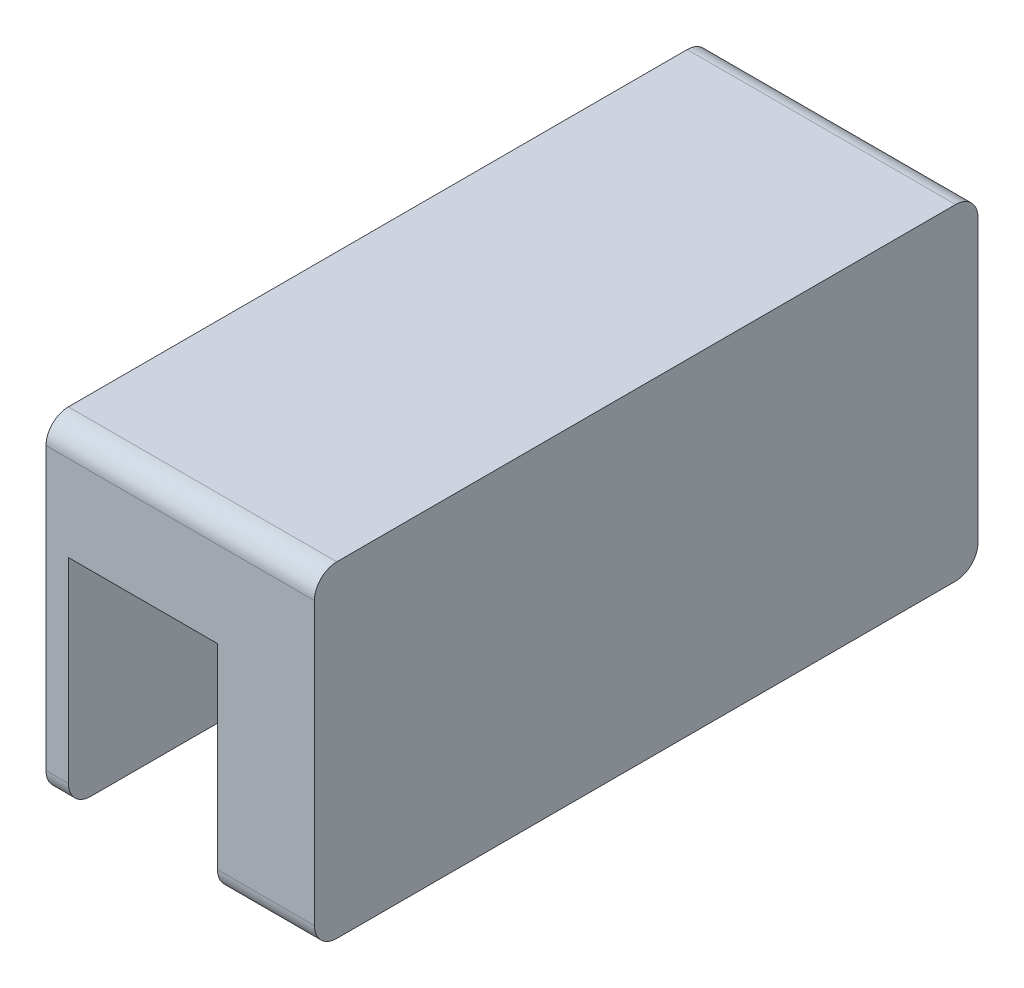
ISO-10303-21;
HEADER;
FILE_DESCRIPTION(('STEP AP214'),'2;1');
FILE_NAME('part.step','',(''),(''),'','','');
FILE_SCHEMA(('AUTOMOTIVE_DESIGN { 1 0 10303 214 1 1 1 1 }'));
ENDSEC;
DATA;
#1=APPLICATION_CONTEXT('core data for automotive mechanical design processes');
#2=APPLICATION_PROTOCOL_DEFINITION('international standard','automotive_design',2000,#1);
#3=PRODUCT_CONTEXT('',#1,'mechanical');
#4=PRODUCT('Part','Part','',(#3));
#5=PRODUCT_RELATED_PRODUCT_CATEGORY('part','',(#4));
#6=PRODUCT_DEFINITION_FORMATION('','',#4);
#7=PRODUCT_DEFINITION_CONTEXT('part definition',#1,'design');
#8=PRODUCT_DEFINITION('design','',#6,#7);
#9=PRODUCT_DEFINITION_SHAPE('','',#8);
#10=(LENGTH_UNIT() NAMED_UNIT(*) SI_UNIT(.MILLI.,.METRE.));
#11=(NAMED_UNIT(*) PLANE_ANGLE_UNIT() SI_UNIT($,.RADIAN.));
#12=(NAMED_UNIT(*) SI_UNIT($,.STERADIAN.) SOLID_ANGLE_UNIT());
#13=UNCERTAINTY_MEASURE_WITH_UNIT(LENGTH_MEASURE(1.E-05),#10,'distance_accuracy_value','');
#14=(GEOMETRIC_REPRESENTATION_CONTEXT(3) GLOBAL_UNCERTAINTY_ASSIGNED_CONTEXT((#13)) GLOBAL_UNIT_ASSIGNED_CONTEXT((#10,
#11,#12)) REPRESENTATION_CONTEXT('',''));
#15=CARTESIAN_POINT('',(0.,0.,0.));
#16=DIRECTION('',(0.,0.,1.));
#17=DIRECTION('',(1.,0.,0.));
#18=AXIS2_PLACEMENT_3D('',#15,#16,#17);
#19=CARTESIAN_POINT('',(30.,20.9769260765077,-25.4015999198652));
#20=DIRECTION('',(-1.,0.,0.));
#21=DIRECTION('',(0.,0.,1.));
#22=AXIS2_PLACEMENT_3D('',#19,#20,#21);
#23=CYLINDRICAL_SURFACE('',#22,3.);
#24=CARTESIAN_POINT('',(-3.,20.9769260765077,-25.4015999198652));
#25=DIRECTION('',(-1.,0.,0.));
#26=DIRECTION('',(0.,0.,-1.));
#27=AXIS2_PLACEMENT_3D('',#24,#25,#26);
#28=CIRCLE('',#27,3.);
#29=CARTESIAN_POINT('',(-3.,23.9769260765077,-25.4015999198652));
#30=VERTEX_POINT('',#29);
#31=CARTESIAN_POINT('',(-3.,20.9769260765077,-28.4015999198652));
#32=VERTEX_POINT('',#31);
#33=EDGE_CURVE('E249',#30,#32,#28,.T.);
#34=ORIENTED_EDGE('',*,*,#33,.F.);
#35=DIRECTION('',(-1.,0.,0.));
#36=VECTOR('',#35,1.);
#37=CARTESIAN_POINT('',(30.,23.9769260765077,-25.4015999198652));
#38=LINE('',#37,#36);
#39=CARTESIAN_POINT('',(33.,23.9769260765077,-25.4015999198652));
#40=VERTEX_POINT('',#39);
#41=EDGE_CURVE('E11',#40,#30,#38,.T.);
#42=ORIENTED_EDGE('',*,*,#41,.F.);
#43=CARTESIAN_POINT('',(33.,20.9769260765077,-25.4015999198652));
#44=DIRECTION('',(1.,0.,0.));
#45=DIRECTION('',(0.,0.,1.));
#46=AXIS2_PLACEMENT_3D('',#43,#44,#45);
#47=CIRCLE('',#46,3.);
#48=CARTESIAN_POINT('',(33.,20.9769260765077,-28.4015999198652));
#49=VERTEX_POINT('',#48);
#50=EDGE_CURVE('E191',#49,#40,#47,.T.);
#51=ORIENTED_EDGE('',*,*,#50,.F.);
#52=DIRECTION('',(-1.,0.,0.));
#53=VECTOR('',#52,1.);
#54=CARTESIAN_POINT('',(30.,20.9769260765077,-28.4015999198652));
#55=LINE('',#54,#53);
#56=EDGE_CURVE('E303',#49,#32,#55,.T.);
#57=ORIENTED_EDGE('',*,*,#56,.T.);
#58=EDGE_LOOP('',(#34,#42,#51,#57));
#59=FACE_BOUND('',#58,.T.);
#60=ADVANCED_FACE('F33',(#59),#23,.T.);
#61=CARTESIAN_POINT('',(30.,23.9769260765077,57.5984000801349));
#62=DIRECTION('',(0.,-1.,0.));
#63=DIRECTION('',(0.,0.,-1.));
#64=AXIS2_PLACEMENT_3D('',#61,#62,#63);
#65=PLANE('',#64);
#66=DIRECTION('',(0.,0.,-1.));
#67=VECTOR('',#66,1.);
#68=CARTESIAN_POINT('',(-3.,23.9769260765077,16.0984000801349));
#69=LINE('',#68,#67);
#70=CARTESIAN_POINT('',(-3.,23.9769260765077,57.5984000801349));
#71=VERTEX_POINT('',#70);
#72=EDGE_CURVE('E175',#71,#30,#69,.T.);
#73=ORIENTED_EDGE('',*,*,#72,.F.);
#74=DIRECTION('',(-1.,0.,0.));
#75=VECTOR('',#74,1.);
#76=CARTESIAN_POINT('',(30.,23.9769260765077,57.5984000801349));
#77=LINE('',#76,#75);
#78=CARTESIAN_POINT('',(33.,23.9769260765077,57.5984000801349));
#79=VERTEX_POINT('',#78);
#80=EDGE_CURVE('E40',#79,#71,#77,.T.);
#81=ORIENTED_EDGE('',*,*,#80,.F.);
#82=DIRECTION('',(0.,0.,1.));
#83=VECTOR('',#82,1.);
#84=CARTESIAN_POINT('',(33.,23.9769260765077,16.0984000801349));
#85=LINE('',#84,#83);
#86=EDGE_CURVE('E172',#40,#79,#85,.T.);
#87=ORIENTED_EDGE('',*,*,#86,.F.);
#88=ORIENTED_EDGE('',*,*,#41,.T.);
#89=EDGE_LOOP('',(#73,#81,#87,#88));
#90=FACE_BOUND('',#89,.T.);
#91=ADVANCED_FACE('F170',(#90),#65,.F.);
#92=CARTESIAN_POINT('',(30.,20.9769260765077,57.5984000801349));
#93=DIRECTION('',(-1.,0.,0.));
#94=DIRECTION('',(0.,0.,1.));
#95=AXIS2_PLACEMENT_3D('',#92,#93,#94);
#96=CYLINDRICAL_SURFACE('',#95,3.);
#97=CARTESIAN_POINT('',(-3.,20.9769260765077,57.5984000801349));
#98=DIRECTION('',(-1.,0.,0.));
#99=DIRECTION('',(0.,0.,-1.));
#100=AXIS2_PLACEMENT_3D('',#97,#98,#99);
#101=CIRCLE('',#100,3.);
#102=CARTESIAN_POINT('',(-3.,20.9769260765077,60.5984000801349));
#103=VERTEX_POINT('',#102);
#104=EDGE_CURVE('E245',#103,#71,#101,.T.);
#105=ORIENTED_EDGE('',*,*,#104,.F.);
#106=DIRECTION('',(-1.,0.,0.));
#107=VECTOR('',#106,1.);
#108=CARTESIAN_POINT('',(30.,20.9769260765077,60.5984000801349));
#109=LINE('',#108,#107);
#110=CARTESIAN_POINT('',(33.,20.9769260765077,60.5984000801349));
#111=VERTEX_POINT('',#110);
#112=EDGE_CURVE('E179',#111,#103,#109,.T.);
#113=ORIENTED_EDGE('',*,*,#112,.F.);
#114=CARTESIAN_POINT('',(33.,20.9769260765077,57.5984000801349));
#115=DIRECTION('',(1.,0.,0.));
#116=DIRECTION('',(0.,0.,1.));
#117=AXIS2_PLACEMENT_3D('',#114,#115,#116);
#118=CIRCLE('',#117,3.);
#119=EDGE_CURVE('E181',#79,#111,#118,.T.);
#120=ORIENTED_EDGE('',*,*,#119,.F.);
#121=ORIENTED_EDGE('',*,*,#80,.T.);
#122=EDGE_LOOP('',(#105,#113,#120,#121));
#123=FACE_BOUND('',#122,.T.);
#124=ADVANCED_FACE('F182',(#123),#96,.T.);
#125=CARTESIAN_POINT('',(30.,9.47692607650769,60.5984000801349));
#126=DIRECTION('',(0.,0.,-1.));
#127=DIRECTION('',(0.,1.,0.));
#128=AXIS2_PLACEMENT_3D('',#125,#126,#127);
#129=PLANE('',#128);
#130=DIRECTION('',(-1.,0.,0.));
#131=VECTOR('',#130,1.);
#132=CARTESIAN_POINT('',(30.,9.47692607650769,60.5984000801349));
#133=LINE('',#132,#131);
#134=CARTESIAN_POINT('',(20.,9.47692607650769,60.5984000801349));
#135=VERTEX_POINT('',#134);
#136=CARTESIAN_POINT('',(0.,9.47692607650772,60.5984000801349));
#137=VERTEX_POINT('',#136);
#138=EDGE_CURVE('E319',#135,#137,#133,.T.);
#139=ORIENTED_EDGE('',*,*,#138,.F.);
#140=DIRECTION('',(0.,-1.,0.));
#141=VECTOR('',#140,1.);
#142=CARTESIAN_POINT('',(20.,20.9769260765077,60.5984000801349));
#143=LINE('',#142,#141);
#144=CARTESIAN_POINT('',(20.,-16.7730739234923,60.5984000801349));
#145=VERTEX_POINT('',#144);
#146=EDGE_CURVE('E207',#135,#145,#143,.T.);
#147=ORIENTED_EDGE('',*,*,#146,.T.);
#148=DIRECTION('',(1.,0.,0.));
#149=VECTOR('',#148,1.);
#150=CARTESIAN_POINT('',(20.,-16.7730739234923,60.5984000801349));
#151=LINE('',#150,#149);
#152=CARTESIAN_POINT('',(33.,-16.7730739234923,60.5984000801349));
#153=VERTEX_POINT('',#152);
#154=EDGE_CURVE('E221',#145,#153,#151,.T.);
#155=ORIENTED_EDGE('',*,*,#154,.T.);
#156=DIRECTION('',(0.,-1.,0.));
#157=VECTOR('',#156,1.);
#158=CARTESIAN_POINT('',(33.,20.9769260765077,60.5984000801349));
#159=LINE('',#158,#157);
#160=EDGE_CURVE('E186',#111,#153,#159,.T.);
#161=ORIENTED_EDGE('',*,*,#160,.F.);
#162=ORIENTED_EDGE('',*,*,#112,.T.);
#163=DIRECTION('',(0.,1.,0.));
#164=VECTOR('',#163,1.);
#165=CARTESIAN_POINT('',(-3.,15.2269260765077,60.5984000801349));
#166=LINE('',#165,#164);
#167=CARTESIAN_POINT('',(-3.,-16.7730739234923,60.5984000801349));
#168=VERTEX_POINT('',#167);
#169=EDGE_CURVE('E242',#168,#103,#166,.T.);
#170=ORIENTED_EDGE('',*,*,#169,.F.);
#171=DIRECTION('',(1.,0.,0.));
#172=VECTOR('',#171,1.);
#173=CARTESIAN_POINT('',(-3.,-16.7730739234923,60.5984000801349));
#174=LINE('',#173,#172);
#175=CARTESIAN_POINT('',(0.,-16.7730739234923,60.5984000801349));
#176=VERTEX_POINT('',#175);
#177=EDGE_CURVE('E260',#168,#176,#174,.T.);
#178=ORIENTED_EDGE('',*,*,#177,.T.);
#179=DIRECTION('',(0.,1.,0.));
#180=VECTOR('',#179,1.);
#181=CARTESIAN_POINT('',(0.,15.2269260765077,60.5984000801349));
#182=LINE('',#181,#180);
#183=EDGE_CURVE('E241',#176,#137,#182,.T.);
#184=ORIENTED_EDGE('',*,*,#183,.T.);
#185=EDGE_LOOP('',(#139,#147,#155,#161,#162,#170,#178,#184));
#186=FACE_BOUND('',#185,.T.);
#187=ADVANCED_FACE('F323',(#186),#129,.F.);
#188=CARTESIAN_POINT('',(30.,9.47692607650771,57.5984000801349));
#189=DIRECTION('',(-1.,0.,0.));
#190=DIRECTION('',(0.,0.,1.));
#191=AXIS2_PLACEMENT_3D('',#188,#189,#190);
#192=CYLINDRICAL_SURFACE('',#191,2.99999999999999);
#193=DIRECTION('',(-1.,0.,0.));
#194=VECTOR('',#193,1.);
#195=CARTESIAN_POINT('',(30.,12.3387436807585,56.6984000801349));
#196=LINE('',#195,#194);
#197=CARTESIAN_POINT('',(20.,12.3387436807585,56.6984000801349));
#198=VERTEX_POINT('',#197);
#199=CARTESIAN_POINT('',(0.,12.3387436807585,56.6984000801349));
#200=VERTEX_POINT('',#199);
#201=EDGE_CURVE('E317',#198,#200,#196,.T.);
#202=ORIENTED_EDGE('',*,*,#201,.F.);
#203=CARTESIAN_POINT('',(20.,9.47692607650771,57.5984000801349));
#204=DIRECTION('',(-1.,0.,0.));
#205=DIRECTION('',(0.,0.,1.));
#206=AXIS2_PLACEMENT_3D('',#203,#204,#205);
#207=CIRCLE('',#206,2.99999999999999);
#208=EDGE_CURVE('E47',#198,#135,#207,.F.);
#209=ORIENTED_EDGE('',*,*,#208,.T.);
#210=ORIENTED_EDGE('',*,*,#138,.T.);
#211=CARTESIAN_POINT('',(0.,9.47692607650771,57.5984000801349));
#212=DIRECTION('',(-1.,0.,0.));
#213=DIRECTION('',(0.,0.,1.));
#214=AXIS2_PLACEMENT_3D('',#211,#212,#213);
#215=CIRCLE('',#214,2.99999999999999);
#216=EDGE_CURVE('E282',#137,#200,#215,.T.);
#217=ORIENTED_EDGE('',*,*,#216,.T.);
#218=EDGE_LOOP('',(#202,#209,#210,#217));
#219=FACE_BOUND('',#218,.T.);
#220=ADVANCED_FACE('F341',(#219),#192,.F.);
#221=CARTESIAN_POINT('',(30.,-0.0624659376617931,60.5984000801348));
#222=DIRECTION('',(-1.,0.,0.));
#223=DIRECTION('',(0.,0.,1.));
#224=AXIS2_PLACEMENT_3D('',#221,#222,#223);
#225=CYLINDRICAL_SURFACE('',#224,13.);
#226=DIRECTION('',(-1.,0.,0.));
#227=VECTOR('',#226,1.);
#228=CARTESIAN_POINT('',(30.,5.58970797538169,48.8914393277999));
#229=LINE('',#228,#227);
#230=CARTESIAN_POINT('',(20.,5.58970797538169,48.8914393277999));
#231=VERTEX_POINT('',#230);
#232=CARTESIAN_POINT('',(0.,5.58970797538169,48.8914393277999));
#233=VERTEX_POINT('',#232);
#234=EDGE_CURVE('E315',#231,#233,#229,.T.);
#235=ORIENTED_EDGE('',*,*,#234,.F.);
#236=CARTESIAN_POINT('',(20.,-0.0624659376617931,60.5984000801348));
#237=DIRECTION('',(-1.,0.,0.));
#238=DIRECTION('',(0.,0.,1.));
#239=AXIS2_PLACEMENT_3D('',#236,#237,#238);
#240=CIRCLE('',#239,13.);
#241=EDGE_CURVE('E55',#231,#198,#240,.F.);
#242=ORIENTED_EDGE('',*,*,#241,.T.);
#243=ORIENTED_EDGE('',*,*,#201,.T.);
#244=CARTESIAN_POINT('',(0.,-0.0624659376617931,60.5984000801348));
#245=DIRECTION('',(-1.,0.,0.));
#246=DIRECTION('',(0.,0.,-1.));
#247=AXIS2_PLACEMENT_3D('',#244,#245,#246);
#248=CIRCLE('',#247,13.);
#249=EDGE_CURVE('E285',#200,#233,#248,.T.);
#250=ORIENTED_EDGE('',*,*,#249,.T.);
#251=EDGE_LOOP('',(#235,#242,#243,#250));
#252=FACE_BOUND('',#251,.T.);
#253=ADVANCED_FACE('F395',(#252),#225,.F.);
#254=CARTESIAN_POINT('',(30.,9.93753406233823,39.8860849029268));
#255=DIRECTION('',(-1.,0.,0.));
#256=DIRECTION('',(0.,0.,1.));
#257=AXIS2_PLACEMENT_3D('',#254,#255,#256);
#258=CYLINDRICAL_SURFACE('',#257,10.);
#259=DIRECTION('',(-1.,0.,0.));
#260=VECTOR('',#259,1.);
#261=CARTESIAN_POINT('',(30.,-0.0624659376617792,39.8860849029268));
#262=LINE('',#261,#260);
#263=CARTESIAN_POINT('',(20.,-0.0624659376617792,39.8860849029268));
#264=VERTEX_POINT('',#263);
#265=CARTESIAN_POINT('',(0.,-0.0624659376617792,39.8860849029268));
#266=VERTEX_POINT('',#265);
#267=EDGE_CURVE('E313',#264,#266,#262,.T.);
#268=ORIENTED_EDGE('',*,*,#267,.F.);
#269=CARTESIAN_POINT('',(20.,9.93753406233823,39.8860849029268));
#270=DIRECTION('',(-1.,0.,0.));
#271=DIRECTION('',(0.,0.,1.));
#272=AXIS2_PLACEMENT_3D('',#269,#270,#271);
#273=CIRCLE('',#272,10.);
#274=EDGE_CURVE('E237',#264,#231,#273,.T.);
#275=ORIENTED_EDGE('',*,*,#274,.T.);
#276=ORIENTED_EDGE('',*,*,#234,.T.);
#277=CARTESIAN_POINT('',(0.,9.93753406233823,39.8860849029268));
#278=DIRECTION('',(1.,0.,0.));
#279=DIRECTION('',(0.,0.,-1.));
#280=AXIS2_PLACEMENT_3D('',#277,#278,#279);
#281=CIRCLE('',#280,10.);
#282=EDGE_CURVE('E288',#233,#266,#281,.T.);
#283=ORIENTED_EDGE('',*,*,#282,.T.);
#284=EDGE_LOOP('',(#268,#275,#276,#283));
#285=FACE_BOUND('',#284,.T.);
#286=ADVANCED_FACE('F394',(#285),#258,.T.);
#287=CARTESIAN_POINT('',(30.,-0.0624659376617792,-7.68928474265718));
#288=DIRECTION('',(0.,1.,0.));
#289=DIRECTION('',(0.,0.,1.));
#290=AXIS2_PLACEMENT_3D('',#287,#288,#289);
#291=PLANE('',#290);
#292=DIRECTION('',(-1.,0.,0.));
#293=VECTOR('',#292,1.);
#294=CARTESIAN_POINT('',(30.,-0.0624659376617775,-7.68928474265718));
#295=LINE('',#294,#293);
#296=CARTESIAN_POINT('',(20.,-0.0624659376617775,-7.68928474265718));
#297=VERTEX_POINT('',#296);
#298=CARTESIAN_POINT('',(0.,-0.0624659376617775,-7.68928474265718));
#299=VERTEX_POINT('',#298);
#300=EDGE_CURVE('E311',#297,#299,#295,.T.);
#301=ORIENTED_EDGE('',*,*,#300,.F.);
#302=DIRECTION('',(0.,0.,1.));
#303=VECTOR('',#302,1.);
#304=CARTESIAN_POINT('',(20.,-0.0624659376617792,-7.68928474265718));
#305=LINE('',#304,#303);
#306=EDGE_CURVE('E235',#297,#264,#305,.T.);
#307=ORIENTED_EDGE('',*,*,#306,.T.);
#308=ORIENTED_EDGE('',*,*,#267,.T.);
#309=DIRECTION('',(0.,0.,-1.));
#310=VECTOR('',#309,1.);
#311=CARTESIAN_POINT('',(0.,-0.0624659376617792,-7.68928474265718));
#312=LINE('',#311,#310);
#313=EDGE_CURVE('E291',#266,#299,#312,.T.);
#314=ORIENTED_EDGE('',*,*,#313,.T.);
#315=EDGE_LOOP('',(#301,#307,#308,#314));
#316=FACE_BOUND('',#315,.T.);
#317=ADVANCED_FACE('F390',(#316),#291,.F.);
#318=CARTESIAN_POINT('',(30.,9.93753406233823,-7.68928474265718));
#319=DIRECTION('',(-1.,0.,0.));
#320=DIRECTION('',(0.,0.,1.));
#321=AXIS2_PLACEMENT_3D('',#318,#319,#320);
#322=CYLINDRICAL_SURFACE('',#321,10.);
#323=DIRECTION('',(-1.,0.,0.));
#324=VECTOR('',#323,1.);
#325=CARTESIAN_POINT('',(30.,5.58970797538169,-16.6946391675302));
#326=LINE('',#325,#324);
#327=CARTESIAN_POINT('',(20.,5.58970797538169,-16.6946391675302));
#328=VERTEX_POINT('',#327);
#329=CARTESIAN_POINT('',(0.,5.58970797538169,-16.6946391675302));
#330=VERTEX_POINT('',#329);
#331=EDGE_CURVE('E309',#328,#330,#326,.T.);
#332=ORIENTED_EDGE('',*,*,#331,.F.);
#333=CARTESIAN_POINT('',(20.,9.93753406233823,-7.68928474265718));
#334=DIRECTION('',(-1.,0.,0.));
#335=DIRECTION('',(0.,0.,1.));
#336=AXIS2_PLACEMENT_3D('',#333,#334,#335);
#337=CIRCLE('',#336,10.);
#338=EDGE_CURVE('E233',#328,#297,#337,.T.);
#339=ORIENTED_EDGE('',*,*,#338,.T.);
#340=ORIENTED_EDGE('',*,*,#300,.T.);
#341=CARTESIAN_POINT('',(0.,9.93753406233823,-7.68928474265718));
#342=DIRECTION('',(1.,0.,0.));
#343=DIRECTION('',(0.,0.,1.));
#344=AXIS2_PLACEMENT_3D('',#341,#342,#343);
#345=CIRCLE('',#344,10.);
#346=EDGE_CURVE('E294',#299,#330,#345,.T.);
#347=ORIENTED_EDGE('',*,*,#346,.T.);
#348=EDGE_LOOP('',(#332,#339,#340,#347));
#349=FACE_BOUND('',#348,.T.);
#350=ADVANCED_FACE('F387',(#349),#322,.T.);
#351=CARTESIAN_POINT('',(30.,-0.0624659376617931,-28.4015999198652));
#352=DIRECTION('',(-1.,0.,0.));
#353=DIRECTION('',(0.,0.,1.));
#354=AXIS2_PLACEMENT_3D('',#351,#352,#353);
#355=CYLINDRICAL_SURFACE('',#354,13.);
#356=DIRECTION('',(-1.,0.,0.));
#357=VECTOR('',#356,1.);
#358=CARTESIAN_POINT('',(30.,12.3387436807586,-24.5015999198653));
#359=LINE('',#358,#357);
#360=CARTESIAN_POINT('',(20.,12.3387436807586,-24.5015999198653));
#361=VERTEX_POINT('',#360);
#362=CARTESIAN_POINT('',(0.,12.3387436807586,-24.5015999198653));
#363=VERTEX_POINT('',#362);
#364=EDGE_CURVE('E307',#361,#363,#359,.T.);
#365=ORIENTED_EDGE('',*,*,#364,.F.);
#366=CARTESIAN_POINT('',(20.,-0.0624659376617931,-28.4015999198652));
#367=DIRECTION('',(-1.,0.,0.));
#368=DIRECTION('',(0.,0.,1.));
#369=AXIS2_PLACEMENT_3D('',#366,#367,#368);
#370=CIRCLE('',#369,13.);
#371=EDGE_CURVE('E231',#361,#328,#370,.F.);
#372=ORIENTED_EDGE('',*,*,#371,.T.);
#373=ORIENTED_EDGE('',*,*,#331,.T.);
#374=CARTESIAN_POINT('',(0.,-0.0624659376617931,-28.4015999198652));
#375=DIRECTION('',(-1.,0.,0.));
#376=DIRECTION('',(0.,0.,1.));
#377=AXIS2_PLACEMENT_3D('',#374,#375,#376);
#378=CIRCLE('',#377,13.);
#379=EDGE_CURVE('E297',#330,#363,#378,.T.);
#380=ORIENTED_EDGE('',*,*,#379,.T.);
#381=EDGE_LOOP('',(#365,#372,#373,#380));
#382=FACE_BOUND('',#381,.T.);
#383=ADVANCED_FACE('F381',(#382),#355,.F.);
#384=CARTESIAN_POINT('',(30.,9.47692607650771,-25.4015999198653));
#385=DIRECTION('',(-1.,0.,0.));
#386=DIRECTION('',(0.,0.,1.));
#387=AXIS2_PLACEMENT_3D('',#384,#385,#386);
#388=CYLINDRICAL_SURFACE('',#387,2.99999999999999);
#389=DIRECTION('',(-1.,0.,0.));
#390=VECTOR('',#389,1.);
#391=CARTESIAN_POINT('',(30.,9.47692607650769,-28.4015999198653));
#392=LINE('',#391,#390);
#393=CARTESIAN_POINT('',(20.,9.47692607650769,-28.4015999198653));
#394=VERTEX_POINT('',#393);
#395=CARTESIAN_POINT('',(0.,9.47692607650772,-28.4015999198652));
#396=VERTEX_POINT('',#395);
#397=EDGE_CURVE('E305',#394,#396,#392,.T.);
#398=ORIENTED_EDGE('',*,*,#397,.F.);
#399=CARTESIAN_POINT('',(20.,9.47692607650771,-25.4015999198653));
#400=DIRECTION('',(-1.,0.,0.));
#401=DIRECTION('',(0.,0.,1.));
#402=AXIS2_PLACEMENT_3D('',#399,#400,#401);
#403=CIRCLE('',#402,2.99999999999999);
#404=EDGE_CURVE('E224',#394,#361,#403,.F.);
#405=ORIENTED_EDGE('',*,*,#404,.T.);
#406=ORIENTED_EDGE('',*,*,#364,.T.);
#407=CARTESIAN_POINT('',(0.,9.47692607650771,-25.4015999198653));
#408=DIRECTION('',(-1.,0.,0.));
#409=DIRECTION('',(0.,0.,-1.));
#410=AXIS2_PLACEMENT_3D('',#407,#408,#409);
#411=CIRCLE('',#410,2.99999999999999);
#412=EDGE_CURVE('E300',#363,#396,#411,.T.);
#413=ORIENTED_EDGE('',*,*,#412,.T.);
#414=EDGE_LOOP('',(#398,#405,#406,#413));
#415=FACE_BOUND('',#414,.T.);
#416=ADVANCED_FACE('F378',(#415),#388,.F.);
#417=CARTESIAN_POINT('',(30.,9.47692607650769,-28.4015999198653));
#418=DIRECTION('',(0.,0.,1.));
#419=DIRECTION('',(0.,-1.,0.));
#420=AXIS2_PLACEMENT_3D('',#417,#418,#419);
#421=PLANE('',#420);
#422=DIRECTION('',(0.,1.,0.));
#423=VECTOR('',#422,1.);
#424=CARTESIAN_POINT('',(20.,15.2269260765077,-28.4015999198652));
#425=LINE('',#424,#423);
#426=CARTESIAN_POINT('',(20.,-16.7730739234923,-28.4015999198652));
#427=VERTEX_POINT('',#426);
#428=EDGE_CURVE('E218',#427,#394,#425,.T.);
#429=ORIENTED_EDGE('',*,*,#428,.T.);
#430=ORIENTED_EDGE('',*,*,#397,.T.);
#431=DIRECTION('',(0.,-1.,0.));
#432=VECTOR('',#431,1.);
#433=CARTESIAN_POINT('',(0.,15.2269260765077,-28.4015999198652));
#434=LINE('',#433,#432);
#435=CARTESIAN_POINT('',(0.,-16.7730739234923,-28.4015999198653));
#436=VERTEX_POINT('',#435);
#437=EDGE_CURVE('E263',#396,#436,#434,.T.);
#438=ORIENTED_EDGE('',*,*,#437,.T.);
#439=DIRECTION('',(1.,0.,0.));
#440=VECTOR('',#439,1.);
#441=CARTESIAN_POINT('',(-3.,-16.7730739234923,-28.4015999198653));
#442=LINE('',#441,#440);
#443=CARTESIAN_POINT('',(-3.,-16.7730739234923,-28.4015999198653));
#444=VERTEX_POINT('',#443);
#445=EDGE_CURVE('E279',#444,#436,#442,.T.);
#446=ORIENTED_EDGE('',*,*,#445,.F.);
#447=DIRECTION('',(0.,-1.,0.));
#448=VECTOR('',#447,1.);
#449=CARTESIAN_POINT('',(-3.,15.2269260765077,-28.4015999198652));
#450=LINE('',#449,#448);
#451=EDGE_CURVE('E252',#32,#444,#450,.T.);
#452=ORIENTED_EDGE('',*,*,#451,.F.);
#453=ORIENTED_EDGE('',*,*,#56,.F.);
#454=DIRECTION('',(0.,1.,0.));
#455=VECTOR('',#454,1.);
#456=CARTESIAN_POINT('',(33.,15.2269260765077,-28.4015999198652));
#457=LINE('',#456,#455);
#458=CARTESIAN_POINT('',(33.,-16.7730739234923,-28.4015999198652));
#459=VERTEX_POINT('',#458);
#460=EDGE_CURVE('E204',#459,#49,#457,.T.);
#461=ORIENTED_EDGE('',*,*,#460,.F.);
#462=DIRECTION('',(1.,0.,0.));
#463=VECTOR('',#462,1.);
#464=CARTESIAN_POINT('',(20.,-16.7730739234923,-28.4015999198652));
#465=LINE('',#464,#463);
#466=EDGE_CURVE('E222',#427,#459,#465,.T.);
#467=ORIENTED_EDGE('',*,*,#466,.F.);
#468=EDGE_LOOP('',(#429,#430,#438,#446,#452,#453,#461,#467));
#469=FACE_BOUND('',#468,.T.);
#470=ADVANCED_FACE('F362',(#469),#421,.F.);
#471=CARTESIAN_POINT('',(0.,-16.7730739234923,57.5984000801349));
#472=DIRECTION('',(1.,0.,0.));
#473=DIRECTION('',(0.,0.,-1.));
#474=AXIS2_PLACEMENT_3D('',#471,#472,#473);
#475=PLANE('',#474);
#476=ORIENTED_EDGE('',*,*,#412,.F.);
#477=ORIENTED_EDGE('',*,*,#379,.F.);
#478=ORIENTED_EDGE('',*,*,#346,.F.);
#479=ORIENTED_EDGE('',*,*,#313,.F.);
#480=ORIENTED_EDGE('',*,*,#282,.F.);
#481=ORIENTED_EDGE('',*,*,#249,.F.);
#482=ORIENTED_EDGE('',*,*,#216,.F.);
#483=ORIENTED_EDGE('',*,*,#183,.F.);
#484=CARTESIAN_POINT('',(0.,-16.7730739234923,57.5984000801349));
#485=DIRECTION('',(-1.,0.,0.));
#486=DIRECTION('',(0.,0.,-1.));
#487=AXIS2_PLACEMENT_3D('',#484,#485,#486);
#488=CIRCLE('',#487,3.);
#489=CARTESIAN_POINT('',(0.,-19.7730739234923,57.5984000801349));
#490=VERTEX_POINT('',#489);
#491=EDGE_CURVE('E246',#490,#176,#488,.T.);
#492=ORIENTED_EDGE('',*,*,#491,.F.);
#493=DIRECTION('',(0.,0.,1.));
#494=VECTOR('',#493,1.);
#495=CARTESIAN_POINT('',(0.,-19.7730739234923,57.5984000801349));
#496=LINE('',#495,#494);
#497=CARTESIAN_POINT('',(0.,-19.7730739234923,-25.4015999198652));
#498=VERTEX_POINT('',#497);
#499=EDGE_CURVE('E267',#498,#490,#496,.T.);
#500=ORIENTED_EDGE('',*,*,#499,.F.);
#501=CARTESIAN_POINT('',(0.,-16.7730739234923,-25.4015999198653));
#502=DIRECTION('',(-1.,0.,0.));
#503=DIRECTION('',(0.,0.,1.));
#504=AXIS2_PLACEMENT_3D('',#501,#502,#503);
#505=CIRCLE('',#504,3.);
#506=EDGE_CURVE('E265',#436,#498,#505,.T.);
#507=ORIENTED_EDGE('',*,*,#506,.F.);
#508=ORIENTED_EDGE('',*,*,#437,.F.);
#509=EDGE_LOOP('',(#476,#477,#478,#479,#480,#481,#482,#483,#492,#500,#507,#508));
#510=FACE_BOUND('',#509,.T.);
#511=ADVANCED_FACE('F337',(#510),#475,.T.);
#512=CARTESIAN_POINT('',(-3.,-16.7730739234923,-25.4015999198653));
#513=DIRECTION('',(1.,0.,0.));
#514=DIRECTION('',(0.,0.,-1.));
#515=AXIS2_PLACEMENT_3D('',#512,#513,#514);
#516=CYLINDRICAL_SURFACE('',#515,3.);
#517=ORIENTED_EDGE('',*,*,#506,.T.);
#518=DIRECTION('',(1.,0.,0.));
#519=VECTOR('',#518,1.);
#520=CARTESIAN_POINT('',(-3.,-19.7730739234923,-25.4015999198652));
#521=LINE('',#520,#519);
#522=CARTESIAN_POINT('',(-3.,-19.7730739234923,-25.4015999198652));
#523=VERTEX_POINT('',#522);
#524=EDGE_CURVE('E276',#523,#498,#521,.T.);
#525=ORIENTED_EDGE('',*,*,#524,.F.);
#526=CARTESIAN_POINT('',(-3.,-16.7730739234923,-25.4015999198653));
#527=DIRECTION('',(-1.,0.,0.));
#528=DIRECTION('',(0.,0.,1.));
#529=AXIS2_PLACEMENT_3D('',#526,#527,#528);
#530=CIRCLE('',#529,3.);
#531=EDGE_CURVE('E254',#444,#523,#530,.T.);
#532=ORIENTED_EDGE('',*,*,#531,.F.);
#533=ORIENTED_EDGE('',*,*,#445,.T.);
#534=EDGE_LOOP('',(#517,#525,#532,#533));
#535=FACE_BOUND('',#534,.T.);
#536=ADVANCED_FACE('F373',(#535),#516,.T.);
#537=CARTESIAN_POINT('',(-3.,-19.7730739234923,57.5984000801349));
#538=DIRECTION('',(0.,1.,0.));
#539=DIRECTION('',(0.,0.,1.));
#540=AXIS2_PLACEMENT_3D('',#537,#538,#539);
#541=PLANE('',#540);
#542=ORIENTED_EDGE('',*,*,#499,.T.);
#543=DIRECTION('',(1.,0.,0.));
#544=VECTOR('',#543,1.);
#545=CARTESIAN_POINT('',(-3.,-19.7730739234923,57.5984000801349));
#546=LINE('',#545,#544);
#547=CARTESIAN_POINT('',(-3.,-19.7730739234923,57.5984000801349));
#548=VERTEX_POINT('',#547);
#549=EDGE_CURVE('E273',#548,#490,#546,.T.);
#550=ORIENTED_EDGE('',*,*,#549,.F.);
#551=DIRECTION('',(0.,0.,1.));
#552=VECTOR('',#551,1.);
#553=CARTESIAN_POINT('',(-3.,-19.7730739234923,57.5984000801349));
#554=LINE('',#553,#552);
#555=EDGE_CURVE('E256',#523,#548,#554,.T.);
#556=ORIENTED_EDGE('',*,*,#555,.F.);
#557=ORIENTED_EDGE('',*,*,#524,.T.);
#558=EDGE_LOOP('',(#542,#550,#556,#557));
#559=FACE_BOUND('',#558,.T.);
#560=ADVANCED_FACE('F375',(#559),#541,.F.);
#561=CARTESIAN_POINT('',(-3.,-16.7730739234923,57.5984000801349));
#562=DIRECTION('',(1.,0.,0.));
#563=DIRECTION('',(0.,0.,-1.));
#564=AXIS2_PLACEMENT_3D('',#561,#562,#563);
#565=CYLINDRICAL_SURFACE('',#564,3.);
#566=ORIENTED_EDGE('',*,*,#491,.T.);
#567=ORIENTED_EDGE('',*,*,#177,.F.);
#568=CARTESIAN_POINT('',(-3.,-16.7730739234923,57.5984000801349));
#569=DIRECTION('',(-1.,0.,0.));
#570=DIRECTION('',(0.,0.,-1.));
#571=AXIS2_PLACEMENT_3D('',#568,#569,#570);
#572=CIRCLE('',#571,3.);
#573=EDGE_CURVE('E258',#548,#168,#572,.T.);
#574=ORIENTED_EDGE('',*,*,#573,.F.);
#575=ORIENTED_EDGE('',*,*,#549,.T.);
#576=EDGE_LOOP('',(#566,#567,#574,#575));
#577=FACE_BOUND('',#576,.T.);
#578=ADVANCED_FACE('F331',(#577),#565,.T.);
#579=CARTESIAN_POINT('',(-3.,-16.7730739234923,57.5984000801349));
#580=DIRECTION('',(1.,0.,0.));
#581=DIRECTION('',(0.,0.,-1.));
#582=AXIS2_PLACEMENT_3D('',#579,#580,#581);
#583=PLANE('',#582);
#584=ORIENTED_EDGE('',*,*,#169,.T.);
#585=ORIENTED_EDGE('',*,*,#104,.T.);
#586=ORIENTED_EDGE('',*,*,#72,.T.);
#587=ORIENTED_EDGE('',*,*,#33,.T.);
#588=ORIENTED_EDGE('',*,*,#451,.T.);
#589=ORIENTED_EDGE('',*,*,#531,.T.);
#590=ORIENTED_EDGE('',*,*,#555,.T.);
#591=ORIENTED_EDGE('',*,*,#573,.T.);
#592=EDGE_LOOP('',(#584,#585,#586,#587,#588,#589,#590,#591));
#593=FACE_BOUND('',#592,.T.);
#594=ADVANCED_FACE('F325',(#593),#583,.F.);
#595=CARTESIAN_POINT('',(20.,20.9769260765077,57.5984000801349));
#596=DIRECTION('',(-1.,0.,0.));
#597=DIRECTION('',(0.,0.,1.));
#598=AXIS2_PLACEMENT_3D('',#595,#596,#597);
#599=PLANE('',#598);
#600=ORIENTED_EDGE('',*,*,#208,.F.);
#601=ORIENTED_EDGE('',*,*,#241,.F.);
#602=ORIENTED_EDGE('',*,*,#274,.F.);
#603=ORIENTED_EDGE('',*,*,#306,.F.);
#604=ORIENTED_EDGE('',*,*,#338,.F.);
#605=ORIENTED_EDGE('',*,*,#371,.F.);
#606=ORIENTED_EDGE('',*,*,#404,.F.);
#607=ORIENTED_EDGE('',*,*,#428,.F.);
#608=CARTESIAN_POINT('',(20.,-16.7730739234923,-25.4015999198652));
#609=DIRECTION('',(1.,0.,0.));
#610=DIRECTION('',(0.,0.,1.));
#611=AXIS2_PLACEMENT_3D('',#608,#609,#610);
#612=CIRCLE('',#611,3.);
#613=CARTESIAN_POINT('',(20.,-19.7730739234923,-25.4015999198652));
#614=VERTEX_POINT('',#613);
#615=EDGE_CURVE('E215',#614,#427,#612,.T.);
#616=ORIENTED_EDGE('',*,*,#615,.F.);
#617=DIRECTION('',(0.,0.,-1.));
#618=VECTOR('',#617,1.);
#619=CARTESIAN_POINT('',(20.,-19.7730739234923,-25.4015999198652));
#620=LINE('',#619,#618);
#621=CARTESIAN_POINT('',(20.,-19.7730739234923,57.5984000801349));
#622=VERTEX_POINT('',#621);
#623=EDGE_CURVE('E212',#622,#614,#620,.T.);
#624=ORIENTED_EDGE('',*,*,#623,.F.);
#625=CARTESIAN_POINT('',(20.,-16.7730739234923,57.5984000801349));
#626=DIRECTION('',(1.,0.,0.));
#627=DIRECTION('',(0.,0.,-1.));
#628=AXIS2_PLACEMENT_3D('',#625,#626,#627);
#629=CIRCLE('',#628,3.);
#630=EDGE_CURVE('E209',#145,#622,#629,.T.);
#631=ORIENTED_EDGE('',*,*,#630,.F.);
#632=ORIENTED_EDGE('',*,*,#146,.F.);
#633=EDGE_LOOP('',(#600,#601,#602,#603,#604,#605,#606,#607,#616,#624,#631,#632));
#634=FACE_BOUND('',#633,.T.);
#635=ADVANCED_FACE('F343',(#634),#599,.T.);
#636=CARTESIAN_POINT('',(20.,-16.7730739234923,-25.4015999198652));
#637=DIRECTION('',(1.,0.,0.));
#638=DIRECTION('',(0.,0.,-1.));
#639=AXIS2_PLACEMENT_3D('',#636,#637,#638);
#640=CYLINDRICAL_SURFACE('',#639,3.);
#641=ORIENTED_EDGE('',*,*,#466,.T.);
#642=CARTESIAN_POINT('',(33.,-16.7730739234923,-25.4015999198652));
#643=DIRECTION('',(1.,0.,0.));
#644=DIRECTION('',(0.,0.,1.));
#645=AXIS2_PLACEMENT_3D('',#642,#643,#644);
#646=CIRCLE('',#645,3.);
#647=CARTESIAN_POINT('',(33.,-19.7730739234923,-25.4015999198652));
#648=VERTEX_POINT('',#647);
#649=EDGE_CURVE('E201',#648,#459,#646,.T.);
#650=ORIENTED_EDGE('',*,*,#649,.F.);
#651=DIRECTION('',(1.,0.,0.));
#652=VECTOR('',#651,1.);
#653=CARTESIAN_POINT('',(20.,-19.7730739234923,-25.4015999198652));
#654=LINE('',#653,#652);
#655=EDGE_CURVE('E225',#614,#648,#654,.T.);
#656=ORIENTED_EDGE('',*,*,#655,.F.);
#657=ORIENTED_EDGE('',*,*,#615,.T.);
#658=EDGE_LOOP('',(#641,#650,#656,#657));
#659=FACE_BOUND('',#658,.T.);
#660=ADVANCED_FACE('F357',(#659),#640,.T.);
#661=CARTESIAN_POINT('',(20.,-19.7730739234923,-25.4015999198652));
#662=DIRECTION('',(0.,-1.,0.));
#663=DIRECTION('',(0.,0.,-1.));
#664=AXIS2_PLACEMENT_3D('',#661,#662,#663);
#665=PLANE('',#664);
#666=ORIENTED_EDGE('',*,*,#655,.T.);
#667=DIRECTION('',(0.,0.,-1.));
#668=VECTOR('',#667,1.);
#669=CARTESIAN_POINT('',(33.,-19.7730739234923,-25.4015999198652));
#670=LINE('',#669,#668);
#671=CARTESIAN_POINT('',(33.,-19.7730739234923,57.5984000801349));
#672=VERTEX_POINT('',#671);
#673=EDGE_CURVE('E198',#672,#648,#670,.T.);
#674=ORIENTED_EDGE('',*,*,#673,.F.);
#675=DIRECTION('',(1.,0.,0.));
#676=VECTOR('',#675,1.);
#677=CARTESIAN_POINT('',(20.,-19.7730739234923,57.5984000801349));
#678=LINE('',#677,#676);
#679=EDGE_CURVE('E227',#622,#672,#678,.T.);
#680=ORIENTED_EDGE('',*,*,#679,.F.);
#681=ORIENTED_EDGE('',*,*,#623,.T.);
#682=EDGE_LOOP('',(#666,#674,#680,#681));
#683=FACE_BOUND('',#682,.T.);
#684=ADVANCED_FACE('F354',(#683),#665,.T.);
#685=CARTESIAN_POINT('',(20.,-16.7730739234923,57.5984000801349));
#686=DIRECTION('',(1.,0.,0.));
#687=DIRECTION('',(0.,0.,-1.));
#688=AXIS2_PLACEMENT_3D('',#685,#686,#687);
#689=CYLINDRICAL_SURFACE('',#688,3.);
#690=ORIENTED_EDGE('',*,*,#679,.T.);
#691=CARTESIAN_POINT('',(33.,-16.7730739234923,57.5984000801349));
#692=DIRECTION('',(1.,0.,0.));
#693=DIRECTION('',(0.,0.,-1.));
#694=AXIS2_PLACEMENT_3D('',#691,#692,#693);
#695=CIRCLE('',#694,3.);
#696=EDGE_CURVE('E195',#153,#672,#695,.T.);
#697=ORIENTED_EDGE('',*,*,#696,.F.);
#698=ORIENTED_EDGE('',*,*,#154,.F.);
#699=ORIENTED_EDGE('',*,*,#630,.T.);
#700=EDGE_LOOP('',(#690,#697,#698,#699));
#701=FACE_BOUND('',#700,.T.);
#702=ADVANCED_FACE('F350',(#701),#689,.T.);
#703=CARTESIAN_POINT('',(33.,20.9769260765077,57.5984000801349));
#704=DIRECTION('',(-1.,0.,0.));
#705=DIRECTION('',(0.,0.,1.));
#706=AXIS2_PLACEMENT_3D('',#703,#704,#705);
#707=PLANE('',#706);
#708=ORIENTED_EDGE('',*,*,#86,.T.);
#709=ORIENTED_EDGE('',*,*,#119,.T.);
#710=ORIENTED_EDGE('',*,*,#160,.T.);
#711=ORIENTED_EDGE('',*,*,#696,.T.);
#712=ORIENTED_EDGE('',*,*,#673,.T.);
#713=ORIENTED_EDGE('',*,*,#649,.T.);
#714=ORIENTED_EDGE('',*,*,#460,.T.);
#715=ORIENTED_EDGE('',*,*,#50,.T.);
#716=EDGE_LOOP('',(#708,#709,#710,#711,#712,#713,#714,#715));
#717=FACE_BOUND('',#716,.T.);
#718=ADVANCED_FACE('F188',(#717),#707,.F.);
#719=CLOSED_SHELL('',(#60,#91,#124,#187,#220,#253,#286,#317,#350,#383,#416,#470,#511,#536,#560,
#578,#594,#635,#660,#684,#702,#718));
#720=MANIFOLD_SOLID_BREP('B2',#719);
#721=ADVANCED_BREP_SHAPE_REPRESENTATION('',(#18,#720),#14);
#722=SHAPE_DEFINITION_REPRESENTATION(#9,#721);
ENDSEC;
END-ISO-10303-21;
